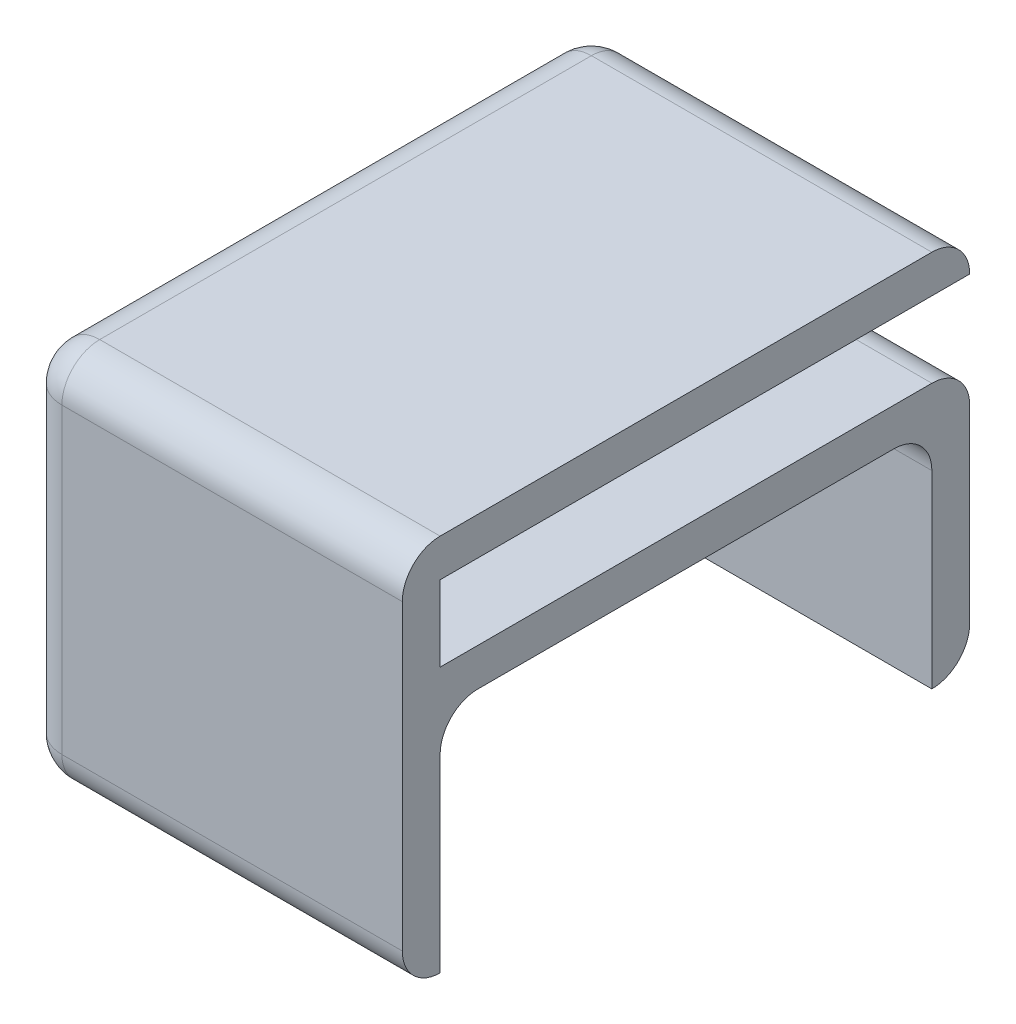
ISO-10303-21;
HEADER;
FILE_DESCRIPTION(('STEP AP214'),'2;1');
FILE_NAME('part.step','',(''),(''),'','','');
FILE_SCHEMA(('AUTOMOTIVE_DESIGN { 1 0 10303 214 1 1 1 1 }'));
ENDSEC;
DATA;
#1=APPLICATION_CONTEXT('core data for automotive mechanical design processes');
#2=APPLICATION_PROTOCOL_DEFINITION('international standard','automotive_design',2000,#1);
#3=PRODUCT_CONTEXT('',#1,'mechanical');
#4=PRODUCT('Part','Part','',(#3));
#5=PRODUCT_RELATED_PRODUCT_CATEGORY('part','',(#4));
#6=PRODUCT_DEFINITION_FORMATION('','',#4);
#7=PRODUCT_DEFINITION_CONTEXT('part definition',#1,'design');
#8=PRODUCT_DEFINITION('design','',#6,#7);
#9=PRODUCT_DEFINITION_SHAPE('','',#8);
#10=(LENGTH_UNIT() NAMED_UNIT(*) SI_UNIT(.MILLI.,.METRE.));
#11=(NAMED_UNIT(*) PLANE_ANGLE_UNIT() SI_UNIT($,.RADIAN.));
#12=(NAMED_UNIT(*) SI_UNIT($,.STERADIAN.) SOLID_ANGLE_UNIT());
#13=UNCERTAINTY_MEASURE_WITH_UNIT(LENGTH_MEASURE(1.E-05),#10,'distance_accuracy_value','');
#14=(GEOMETRIC_REPRESENTATION_CONTEXT(3) GLOBAL_UNCERTAINTY_ASSIGNED_CONTEXT((#13)) GLOBAL_UNIT_ASSIGNED_CONTEXT((#10,
#11,#12)) REPRESENTATION_CONTEXT('',''));
#15=CARTESIAN_POINT('',(0.,0.,0.));
#16=DIRECTION('',(0.,0.,1.));
#17=DIRECTION('',(1.,0.,0.));
#18=AXIS2_PLACEMENT_3D('',#15,#16,#17);
#19=CARTESIAN_POINT('',(1.,10.,0.));
#20=DIRECTION('',(1.,0.,0.));
#21=DIRECTION('',(0.,0.,-1.));
#22=AXIS2_PLACEMENT_3D('',#19,#20,#21);
#23=PLANE('',#22);
#24=DIRECTION('',(0.,-1.,0.));
#25=VECTOR('',#24,1.);
#26=CARTESIAN_POINT('',(1.,10.,-14.));
#27=LINE('',#26,#25);
#28=CARTESIAN_POINT('',(1.,5.,-14.));
#29=VERTEX_POINT('',#28);
#30=CARTESIAN_POINT('',(1.,0.,-14.));
#31=VERTEX_POINT('',#30);
#32=EDGE_CURVE('E179',#29,#31,#27,.T.);
#33=ORIENTED_EDGE('',*,*,#32,.F.);
#34=CARTESIAN_POINT('',(1.,5.,-13.));
#35=DIRECTION('',(1.,0.,0.));
#36=DIRECTION('',(0.,0.,-1.));
#37=AXIS2_PLACEMENT_3D('',#34,#35,#36);
#38=CIRCLE('',#37,1.);
#39=CARTESIAN_POINT('',(1.,6.,-13.));
#40=VERTEX_POINT('',#39);
#41=EDGE_CURVE('E260',#29,#40,#38,.T.);
#42=ORIENTED_EDGE('',*,*,#41,.T.);
#43=DIRECTION('',(0.,0.,-1.));
#44=VECTOR('',#43,1.);
#45=CARTESIAN_POINT('',(1.,6.,0.00200000000000027));
#46=LINE('',#45,#44);
#47=CARTESIAN_POINT('',(1.,6.,-2.));
#48=VERTEX_POINT('',#47);
#49=EDGE_CURVE('E287',#48,#40,#46,.T.);
#50=ORIENTED_EDGE('',*,*,#49,.F.);
#51=CARTESIAN_POINT('',(1.,5.,-2.));
#52=DIRECTION('',(1.,0.,0.));
#53=DIRECTION('',(0.,0.,-1.));
#54=AXIS2_PLACEMENT_3D('',#51,#52,#53);
#55=CIRCLE('',#54,1.);
#56=CARTESIAN_POINT('',(1.,5.,-1.));
#57=VERTEX_POINT('',#56);
#58=EDGE_CURVE('E56',#48,#57,#55,.T.);
#59=ORIENTED_EDGE('',*,*,#58,.T.);
#60=DIRECTION('',(0.,-1.,0.));
#61=VECTOR('',#60,1.);
#62=CARTESIAN_POINT('',(1.,10.,-1.));
#63=LINE('',#62,#61);
#64=CARTESIAN_POINT('',(1.,0.,-1.));
#65=VERTEX_POINT('',#64);
#66=EDGE_CURVE('E315',#57,#65,#63,.T.);
#67=ORIENTED_EDGE('',*,*,#66,.T.);
#68=DIRECTION('',(0.,0.,1.));
#69=VECTOR('',#68,1.);
#70=CARTESIAN_POINT('',(1.,0.,-14.));
#71=LINE('',#70,#69);
#72=EDGE_CURVE('E413',#31,#65,#71,.T.);
#73=ORIENTED_EDGE('',*,*,#72,.F.);
#74=EDGE_LOOP('',(#33,#42,#50,#59,#67,#73));
#75=FACE_BOUND('',#74,.T.);
#76=ADVANCED_FACE('F40',(#75),#23,.T.);
#77=CARTESIAN_POINT('',(1.,9.,-1.));
#78=VERTEX_POINT('',#77);
#79=CARTESIAN_POINT('',(1.,7.,-1.));
#80=VERTEX_POINT('',#79);
#81=EDGE_CURVE('E310',#78,#80,#63,.T.);
#82=ORIENTED_EDGE('',*,*,#81,.T.);
#83=DIRECTION('',(0.,0.,-1.));
#84=VECTOR('',#83,1.);
#85=CARTESIAN_POINT('',(1.,7.,0.00200000000000027));
#86=LINE('',#85,#84);
#87=CARTESIAN_POINT('',(1.,7.,-14.));
#88=VERTEX_POINT('',#87);
#89=EDGE_CURVE('E306',#80,#88,#86,.T.);
#90=ORIENTED_EDGE('',*,*,#89,.T.);
#91=CARTESIAN_POINT('',(1.,6.,-14.));
#92=DIRECTION('',(1.,0.,0.));
#93=DIRECTION('',(0.,0.,-1.));
#94=AXIS2_PLACEMENT_3D('',#91,#92,#93);
#95=CIRCLE('',#94,1.);
#96=CARTESIAN_POINT('',(1.,6.,-15.));
#97=VERTEX_POINT('',#96);
#98=EDGE_CURVE('E266',#88,#97,#95,.F.);
#99=ORIENTED_EDGE('',*,*,#98,.T.);
#100=DIRECTION('',(0.,-1.,0.));
#101=VECTOR('',#100,1.);
#102=CARTESIAN_POINT('',(1.,9.,-15.));
#103=LINE('',#102,#101);
#104=CARTESIAN_POINT('',(1.,9.,-15.));
#105=VERTEX_POINT('',#104);
#106=EDGE_CURVE('E192',#105,#97,#103,.T.);
#107=ORIENTED_EDGE('',*,*,#106,.F.);
#108=DIRECTION('',(0.,0.,1.));
#109=VECTOR('',#108,1.);
#110=CARTESIAN_POINT('',(1.,9.,0.));
#111=LINE('',#110,#109);
#112=EDGE_CURVE('E186',#105,#78,#111,.T.);
#113=ORIENTED_EDGE('',*,*,#112,.T.);
#114=EDGE_LOOP('',(#82,#90,#99,#107,#113));
#115=FACE_BOUND('',#114,.T.);
#116=ADVANCED_FACE('F411',(#115),#23,.T.);
#117=CARTESIAN_POINT('',(0.,10.,-1.));
#118=DIRECTION('',(0.,0.,-1.));
#119=DIRECTION('',(-1.,0.,0.));
#120=AXIS2_PLACEMENT_3D('',#117,#118,#119);
#121=PLANE('',#120);
#122=ORIENTED_EDGE('',*,*,#66,.F.);
#123=DIRECTION('',(-1.,0.,0.));
#124=VECTOR('',#123,1.);
#125=CARTESIAN_POINT('',(0.,5.,-1.));
#126=LINE('',#125,#124);
#127=CARTESIAN_POINT('',(10.,5.,-1.));
#128=VERTEX_POINT('',#127);
#129=EDGE_CURVE('E263',#57,#128,#126,.F.);
#130=ORIENTED_EDGE('',*,*,#129,.T.);
#131=DIRECTION('',(0.,-1.,0.));
#132=VECTOR('',#131,1.);
#133=CARTESIAN_POINT('',(10.,10.,-1.));
#134=LINE('',#133,#132);
#135=CARTESIAN_POINT('',(10.,0.,-1.));
#136=VERTEX_POINT('',#135);
#137=EDGE_CURVE('E282',#128,#136,#134,.T.);
#138=ORIENTED_EDGE('',*,*,#137,.T.);
#139=DIRECTION('',(1.,0.,0.));
#140=VECTOR('',#139,1.);
#141=CARTESIAN_POINT('',(1.,0.,-1.));
#142=LINE('',#141,#140);
#143=EDGE_CURVE('E417',#65,#136,#142,.T.);
#144=ORIENTED_EDGE('',*,*,#143,.F.);
#145=EDGE_LOOP('',(#122,#130,#138,#144));
#146=FACE_BOUND('',#145,.T.);
#147=ADVANCED_FACE('F457',(#146),#121,.T.);
#148=CARTESIAN_POINT('',(10.,9.,-1.));
#149=VERTEX_POINT('',#148);
#150=CARTESIAN_POINT('',(10.,7.,-1.));
#151=VERTEX_POINT('',#150);
#152=EDGE_CURVE('E175',#149,#151,#134,.T.);
#153=ORIENTED_EDGE('',*,*,#152,.T.);
#154=DIRECTION('',(1.,0.,0.));
#155=VECTOR('',#154,1.);
#156=CARTESIAN_POINT('',(1.,7.,-1.));
#157=LINE('',#156,#155);
#158=EDGE_CURVE('E293',#80,#151,#157,.T.);
#159=ORIENTED_EDGE('',*,*,#158,.F.);
#160=ORIENTED_EDGE('',*,*,#81,.F.);
#161=DIRECTION('',(1.,0.,0.));
#162=VECTOR('',#161,1.);
#163=CARTESIAN_POINT('',(0.,9.,-1.));
#164=LINE('',#163,#162);
#165=EDGE_CURVE('E180',#78,#149,#164,.T.);
#166=ORIENTED_EDGE('',*,*,#165,.T.);
#167=EDGE_LOOP('',(#153,#159,#160,#166));
#168=FACE_BOUND('',#167,.T.);
#169=ADVANCED_FACE('F409',(#168),#121,.T.);
#170=CARTESIAN_POINT('',(0.,10.,-14.));
#171=DIRECTION('',(0.,0.,1.));
#172=DIRECTION('',(1.,0.,0.));
#173=AXIS2_PLACEMENT_3D('',#170,#171,#172);
#174=PLANE('',#173);
#175=DIRECTION('',(0.,-1.,0.));
#176=VECTOR('',#175,1.);
#177=CARTESIAN_POINT('',(10.,10.,-14.));
#178=LINE('',#177,#176);
#179=CARTESIAN_POINT('',(10.,5.,-14.));
#180=VERTEX_POINT('',#179);
#181=CARTESIAN_POINT('',(10.,0.,-14.));
#182=VERTEX_POINT('',#181);
#183=EDGE_CURVE('E271',#180,#182,#178,.T.);
#184=ORIENTED_EDGE('',*,*,#183,.F.);
#185=DIRECTION('',(1.,0.,0.));
#186=VECTOR('',#185,1.);
#187=CARTESIAN_POINT('',(0.,5.,-14.));
#188=LINE('',#187,#186);
#189=EDGE_CURVE('E64',#180,#29,#188,.F.);
#190=ORIENTED_EDGE('',*,*,#189,.T.);
#191=ORIENTED_EDGE('',*,*,#32,.T.);
#192=DIRECTION('',(-1.,0.,0.));
#193=VECTOR('',#192,1.);
#194=CARTESIAN_POINT('',(1.,0.,-14.));
#195=LINE('',#194,#193);
#196=EDGE_CURVE('E279',#182,#31,#195,.T.);
#197=ORIENTED_EDGE('',*,*,#196,.F.);
#198=EDGE_LOOP('',(#184,#190,#191,#197));
#199=FACE_BOUND('',#198,.T.);
#200=ADVANCED_FACE('F277',(#199),#174,.T.);
#201=CARTESIAN_POINT('',(10.,10.,0.));
#202=DIRECTION('',(-1.,0.,0.));
#203=DIRECTION('',(0.,0.,1.));
#204=AXIS2_PLACEMENT_3D('',#201,#202,#203);
#205=PLANE('',#204);
#206=DIRECTION('',(0.,-1.,0.));
#207=VECTOR('',#206,1.);
#208=CARTESIAN_POINT('',(10.,10.,-15.));
#209=LINE('',#208,#207);
#210=CARTESIAN_POINT('',(10.,6.,-15.));
#211=VERTEX_POINT('',#210);
#212=CARTESIAN_POINT('',(10.,0.999999999999999,-15.));
#213=VERTEX_POINT('',#212);
#214=EDGE_CURVE('E326',#211,#213,#209,.T.);
#215=ORIENTED_EDGE('',*,*,#214,.F.);
#216=CARTESIAN_POINT('',(10.,6.,-14.));
#217=DIRECTION('',(-1.,0.,0.));
#218=DIRECTION('',(0.,0.,1.));
#219=AXIS2_PLACEMENT_3D('',#216,#217,#218);
#220=CIRCLE('',#219,1.);
#221=CARTESIAN_POINT('',(10.,7.,-14.));
#222=VERTEX_POINT('',#221);
#223=EDGE_CURVE('E242',#211,#222,#220,.F.);
#224=ORIENTED_EDGE('',*,*,#223,.T.);
#225=DIRECTION('',(0.,0.,-1.));
#226=VECTOR('',#225,1.);
#227=CARTESIAN_POINT('',(10.,7.,0.00200000000000027));
#228=LINE('',#227,#226);
#229=EDGE_CURVE('E297',#151,#222,#228,.T.);
#230=ORIENTED_EDGE('',*,*,#229,.F.);
#231=ORIENTED_EDGE('',*,*,#152,.F.);
#232=DIRECTION('',(0.,0.,-1.));
#233=VECTOR('',#232,1.);
#234=CARTESIAN_POINT('',(10.,9.,0.));
#235=LINE('',#234,#233);
#236=CARTESIAN_POINT('',(10.,9.,-15.));
#237=VERTEX_POINT('',#236);
#238=EDGE_CURVE('E165',#149,#237,#235,.T.);
#239=ORIENTED_EDGE('',*,*,#238,.T.);
#240=CARTESIAN_POINT('',(10.,9.,-14.));
#241=DIRECTION('',(-1.,0.,0.));
#242=DIRECTION('',(0.,0.,1.));
#243=AXIS2_PLACEMENT_3D('',#240,#241,#242);
#244=CIRCLE('',#243,1.);
#245=CARTESIAN_POINT('',(10.,10.,-14.));
#246=VERTEX_POINT('',#245);
#247=EDGE_CURVE('E171',#237,#246,#244,.F.);
#248=ORIENTED_EDGE('',*,*,#247,.T.);
#249=DIRECTION('',(0.,0.,-1.));
#250=VECTOR('',#249,1.);
#251=CARTESIAN_POINT('',(10.,10.,0.));
#252=LINE('',#251,#250);
#253=CARTESIAN_POINT('',(10.,10.,-1.));
#254=VERTEX_POINT('',#253);
#255=EDGE_CURVE('E314',#254,#246,#252,.T.);
#256=ORIENTED_EDGE('',*,*,#255,.F.);
#257=CARTESIAN_POINT('',(10.,9.,-1.));
#258=DIRECTION('',(-1.,0.,0.));
#259=DIRECTION('',(0.,0.,1.));
#260=AXIS2_PLACEMENT_3D('',#257,#258,#259);
#261=CIRCLE('',#260,1.);
#262=CARTESIAN_POINT('',(10.,9.,0.));
#263=VERTEX_POINT('',#262);
#264=EDGE_CURVE('E357',#254,#263,#261,.F.);
#265=ORIENTED_EDGE('',*,*,#264,.T.);
#266=DIRECTION('',(0.,-1.,0.));
#267=VECTOR('',#266,1.);
#268=CARTESIAN_POINT('',(10.,10.,0.));
#269=LINE('',#268,#267);
#270=CARTESIAN_POINT('',(10.,0.999999999999999,0.));
#271=VERTEX_POINT('',#270);
#272=EDGE_CURVE('E329',#263,#271,#269,.T.);
#273=ORIENTED_EDGE('',*,*,#272,.T.);
#274=CARTESIAN_POINT('',(10.,0.999999999999999,-1.));
#275=DIRECTION('',(-1.,0.,0.));
#276=DIRECTION('',(0.,0.,1.));
#277=AXIS2_PLACEMENT_3D('',#274,#275,#276);
#278=CIRCLE('',#277,1.);
#279=EDGE_CURVE('E360',#271,#136,#278,.F.);
#280=ORIENTED_EDGE('',*,*,#279,.T.);
#281=ORIENTED_EDGE('',*,*,#137,.F.);
#282=CARTESIAN_POINT('',(10.,5.,-2.));
#283=DIRECTION('',(-1.,0.,0.));
#284=DIRECTION('',(0.,0.,1.));
#285=AXIS2_PLACEMENT_3D('',#282,#283,#284);
#286=CIRCLE('',#285,1.);
#287=CARTESIAN_POINT('',(10.,6.,-2.));
#288=VERTEX_POINT('',#287);
#289=EDGE_CURVE('E11',#128,#288,#286,.T.);
#290=ORIENTED_EDGE('',*,*,#289,.T.);
#291=DIRECTION('',(0.,0.,-1.));
#292=VECTOR('',#291,1.);
#293=CARTESIAN_POINT('',(10.,6.,0.00200000000000027));
#294=LINE('',#293,#292);
#295=CARTESIAN_POINT('',(10.,6.,-13.));
#296=VERTEX_POINT('',#295);
#297=EDGE_CURVE('E274',#288,#296,#294,.T.);
#298=ORIENTED_EDGE('',*,*,#297,.T.);
#299=CARTESIAN_POINT('',(10.,5.,-13.));
#300=DIRECTION('',(-1.,0.,0.));
#301=DIRECTION('',(0.,0.,1.));
#302=AXIS2_PLACEMENT_3D('',#299,#300,#301);
#303=CIRCLE('',#302,1.);
#304=EDGE_CURVE('E49',#296,#180,#303,.T.);
#305=ORIENTED_EDGE('',*,*,#304,.T.);
#306=ORIENTED_EDGE('',*,*,#183,.T.);
#307=CARTESIAN_POINT('',(10.,0.999999999999999,-14.));
#308=DIRECTION('',(-1.,0.,0.));
#309=DIRECTION('',(0.,0.,1.));
#310=AXIS2_PLACEMENT_3D('',#307,#308,#309);
#311=CIRCLE('',#310,1.);
#312=EDGE_CURVE('E199',#182,#213,#311,.F.);
#313=ORIENTED_EDGE('',*,*,#312,.T.);
#314=EDGE_LOOP('',(#215,#224,#230,#231,#239,#248,#256,#265,#273,#280,#281,#290,#298,#305,#306,#313));
#315=FACE_BOUND('',#314,.T.);
#316=ADVANCED_FACE('F168',(#315),#205,.F.);
#317=CARTESIAN_POINT('',(0.,10.,0.));
#318=DIRECTION('',(1.,0.,0.));
#319=DIRECTION('',(0.,0.,-1.));
#320=AXIS2_PLACEMENT_3D('',#317,#318,#319);
#321=PLANE('',#320);
#322=DIRECTION('',(0.,0.,1.));
#323=VECTOR('',#322,1.);
#324=CARTESIAN_POINT('',(0.,9.,0.));
#325=LINE('',#324,#323);
#326=CARTESIAN_POINT('',(0.,9.,-1.));
#327=VERTEX_POINT('',#326);
#328=CARTESIAN_POINT('',(0.,9.,-14.));
#329=VERTEX_POINT('',#328);
#330=EDGE_CURVE('E337',#327,#329,#325,.F.);
#331=ORIENTED_EDGE('',*,*,#330,.T.);
#332=DIRECTION('',(0.,-1.,0.));
#333=VECTOR('',#332,1.);
#334=CARTESIAN_POINT('',(0.,10.,-14.));
#335=LINE('',#334,#333);
#336=CARTESIAN_POINT('',(0.,0.999999999999999,-14.));
#337=VERTEX_POINT('',#336);
#338=EDGE_CURVE('E215',#329,#337,#335,.T.);
#339=ORIENTED_EDGE('',*,*,#338,.T.);
#340=DIRECTION('',(0.,0.,1.));
#341=VECTOR('',#340,1.);
#342=CARTESIAN_POINT('',(0.,0.999999999999999,0.));
#343=LINE('',#342,#341);
#344=CARTESIAN_POINT('',(0.,0.999999999999999,-1.));
#345=VERTEX_POINT('',#344);
#346=EDGE_CURVE('E341',#337,#345,#343,.T.);
#347=ORIENTED_EDGE('',*,*,#346,.T.);
#348=DIRECTION('',(0.,-1.,0.));
#349=VECTOR('',#348,1.);
#350=CARTESIAN_POINT('',(0.,10.,-1.));
#351=LINE('',#350,#349);
#352=EDGE_CURVE('E368',#345,#327,#351,.F.);
#353=ORIENTED_EDGE('',*,*,#352,.T.);
#354=EDGE_LOOP('',(#331,#339,#347,#353));
#355=FACE_BOUND('',#354,.T.);
#356=ADVANCED_FACE('F466',(#355),#321,.F.);
#357=CARTESIAN_POINT('',(0.,10.,0.));
#358=DIRECTION('',(0.,0.,-1.));
#359=DIRECTION('',(-1.,0.,0.));
#360=AXIS2_PLACEMENT_3D('',#357,#358,#359);
#361=PLANE('',#360);
#362=DIRECTION('',(0.,-1.,0.));
#363=VECTOR('',#362,1.);
#364=CARTESIAN_POINT('',(1.,10.,0.));
#365=LINE('',#364,#363);
#366=CARTESIAN_POINT('',(1.,9.,0.));
#367=VERTEX_POINT('',#366);
#368=CARTESIAN_POINT('',(1.,0.999999999999999,0.));
#369=VERTEX_POINT('',#368);
#370=EDGE_CURVE('E350',#367,#369,#365,.T.);
#371=ORIENTED_EDGE('',*,*,#370,.T.);
#372=DIRECTION('',(1.,0.,0.));
#373=VECTOR('',#372,1.);
#374=CARTESIAN_POINT('',(10.,0.999999999999999,0.));
#375=LINE('',#374,#373);
#376=EDGE_CURVE('E353',#369,#271,#375,.T.);
#377=ORIENTED_EDGE('',*,*,#376,.T.);
#378=ORIENTED_EDGE('',*,*,#272,.F.);
#379=DIRECTION('',(1.,0.,0.));
#380=VECTOR('',#379,1.);
#381=CARTESIAN_POINT('',(0.,9.,0.));
#382=LINE('',#381,#380);
#383=EDGE_CURVE('E347',#263,#367,#382,.F.);
#384=ORIENTED_EDGE('',*,*,#383,.T.);
#385=EDGE_LOOP('',(#371,#377,#378,#384));
#386=FACE_BOUND('',#385,.T.);
#387=ADVANCED_FACE('F584',(#386),#361,.F.);
#388=CARTESIAN_POINT('',(0.,10.,-15.));
#389=DIRECTION('',(0.,0.,1.));
#390=DIRECTION('',(1.,0.,0.));
#391=AXIS2_PLACEMENT_3D('',#388,#389,#390);
#392=PLANE('',#391);
#393=DIRECTION('',(0.,-1.,0.));
#394=VECTOR('',#393,1.);
#395=CARTESIAN_POINT('',(1.,10.,-15.));
#396=LINE('',#395,#394);
#397=CARTESIAN_POINT('',(1.,0.999999999999999,-15.));
#398=VERTEX_POINT('',#397);
#399=EDGE_CURVE('E208',#398,#97,#396,.F.);
#400=ORIENTED_EDGE('',*,*,#399,.T.);
#401=DIRECTION('',(1.,0.,0.));
#402=VECTOR('',#401,1.);
#403=CARTESIAN_POINT('',(0.,6.,-15.));
#404=LINE('',#403,#402);
#405=EDGE_CURVE('E223',#97,#211,#404,.T.);
#406=ORIENTED_EDGE('',*,*,#405,.T.);
#407=ORIENTED_EDGE('',*,*,#214,.T.);
#408=DIRECTION('',(-1.,0.,0.));
#409=VECTOR('',#408,1.);
#410=CARTESIAN_POINT('',(1.,0.999999999999999,-15.));
#411=LINE('',#410,#409);
#412=EDGE_CURVE('E200',#213,#398,#411,.T.);
#413=ORIENTED_EDGE('',*,*,#412,.T.);
#414=EDGE_LOOP('',(#400,#406,#407,#413));
#415=FACE_BOUND('',#414,.T.);
#416=ADVANCED_FACE('F396',(#415),#392,.F.);
#417=CARTESIAN_POINT('',(0.,10.,0.));
#418=DIRECTION('',(0.,-1.,0.));
#419=DIRECTION('',(0.,0.,-1.));
#420=AXIS2_PLACEMENT_3D('',#417,#418,#419);
#421=PLANE('',#420);
#422=ORIENTED_EDGE('',*,*,#255,.T.);
#423=DIRECTION('',(-1.,0.,0.));
#424=VECTOR('',#423,1.);
#425=CARTESIAN_POINT('',(0.,10.,-14.));
#426=LINE('',#425,#424);
#427=CARTESIAN_POINT('',(1.,10.,-14.));
#428=VERTEX_POINT('',#427);
#429=EDGE_CURVE('E197',#246,#428,#426,.T.);
#430=ORIENTED_EDGE('',*,*,#429,.T.);
#431=DIRECTION('',(0.,0.,1.));
#432=VECTOR('',#431,1.);
#433=CARTESIAN_POINT('',(1.,10.,0.));
#434=LINE('',#433,#432);
#435=CARTESIAN_POINT('',(1.,10.,-1.));
#436=VERTEX_POINT('',#435);
#437=EDGE_CURVE('E344',#428,#436,#434,.T.);
#438=ORIENTED_EDGE('',*,*,#437,.T.);
#439=DIRECTION('',(1.,0.,0.));
#440=VECTOR('',#439,1.);
#441=CARTESIAN_POINT('',(0.,10.,-1.));
#442=LINE('',#441,#440);
#443=EDGE_CURVE('E375',#436,#254,#442,.T.);
#444=ORIENTED_EDGE('',*,*,#443,.T.);
#445=EDGE_LOOP('',(#422,#430,#438,#444));
#446=FACE_BOUND('',#445,.T.);
#447=ADVANCED_FACE('F439',(#446),#421,.F.);
#448=CARTESIAN_POINT('',(0.,9.,0.));
#449=DIRECTION('',(0.,-1.,0.));
#450=DIRECTION('',(0.,0.,-1.));
#451=AXIS2_PLACEMENT_3D('',#448,#449,#450);
#452=PLANE('',#451);
#453=CARTESIAN_POINT('',(7.5,9.,-2.5));
#454=DIRECTION('',(0.,-1.,0.));
#455=DIRECTION('',(0.,0.,-1.));
#456=AXIS2_PLACEMENT_3D('',#453,#454,#455);
#457=CIRCLE('',#456,0.5);
#458=CARTESIAN_POINT('',(7.5,9.,-3.));
#459=VERTEX_POINT('',#458);
#460=EDGE_CURVE('E429',#459,#459,#457,.T.);
#461=ORIENTED_EDGE('',*,*,#460,.F.);
#462=EDGE_LOOP('',(#461));
#463=FACE_BOUND('',#462,.T.);
#464=ORIENTED_EDGE('',*,*,#112,.F.);
#465=DIRECTION('',(1.,0.,0.));
#466=VECTOR('',#465,1.);
#467=CARTESIAN_POINT('',(-1.23606797749979,9.,-15.));
#468=LINE('',#467,#466);
#469=EDGE_CURVE('E183',#105,#237,#468,.T.);
#470=ORIENTED_EDGE('',*,*,#469,.T.);
#471=ORIENTED_EDGE('',*,*,#238,.F.);
#472=ORIENTED_EDGE('',*,*,#165,.F.);
#473=EDGE_LOOP('',(#464,#470,#471,#472));
#474=FACE_BOUND('',#473,.T.);
#475=ADVANCED_FACE('F184',(#463,#474),#452,.T.);
#476=CARTESIAN_POINT('',(1.,6.,0.00200000000000027));
#477=DIRECTION('',(0.,1.,0.));
#478=DIRECTION('',(0.,0.,1.));
#479=AXIS2_PLACEMENT_3D('',#476,#477,#478);
#480=PLANE('',#479);
#481=ORIENTED_EDGE('',*,*,#49,.T.);
#482=DIRECTION('',(1.,0.,0.));
#483=VECTOR('',#482,1.);
#484=CARTESIAN_POINT('',(1.,6.,-13.));
#485=LINE('',#484,#483);
#486=EDGE_CURVE('E252',#40,#296,#485,.T.);
#487=ORIENTED_EDGE('',*,*,#486,.T.);
#488=ORIENTED_EDGE('',*,*,#297,.F.);
#489=DIRECTION('',(-1.,0.,0.));
#490=VECTOR('',#489,1.);
#491=CARTESIAN_POINT('',(1.,6.,-2.));
#492=LINE('',#491,#490);
#493=EDGE_CURVE('E248',#288,#48,#492,.T.);
#494=ORIENTED_EDGE('',*,*,#493,.T.);
#495=EDGE_LOOP('',(#481,#487,#488,#494));
#496=FACE_BOUND('',#495,.T.);
#497=ADVANCED_FACE('F290',(#496),#480,.F.);
#498=CARTESIAN_POINT('',(1.,7.,0.00200000000000027));
#499=DIRECTION('',(0.,-1.,0.));
#500=DIRECTION('',(0.,0.,-1.));
#501=AXIS2_PLACEMENT_3D('',#498,#499,#500);
#502=PLANE('',#501);
#503=CARTESIAN_POINT('',(7.5,7.,-2.5));
#504=DIRECTION('',(0.,-1.,0.));
#505=DIRECTION('',(0.,0.,-1.));
#506=AXIS2_PLACEMENT_3D('',#503,#504,#505);
#507=CIRCLE('',#506,0.500000000000001);
#508=CARTESIAN_POINT('',(7.5,7.,-3.));
#509=VERTEX_POINT('',#508);
#510=EDGE_CURVE('E333',#509,#509,#507,.F.);
#511=ORIENTED_EDGE('',*,*,#510,.F.);
#512=EDGE_LOOP('',(#511));
#513=FACE_BOUND('',#512,.T.);
#514=ORIENTED_EDGE('',*,*,#229,.T.);
#515=DIRECTION('',(1.,0.,0.));
#516=VECTOR('',#515,1.);
#517=CARTESIAN_POINT('',(1.,7.,-14.));
#518=LINE('',#517,#516);
#519=EDGE_CURVE('E245',#222,#88,#518,.F.);
#520=ORIENTED_EDGE('',*,*,#519,.T.);
#521=ORIENTED_EDGE('',*,*,#89,.F.);
#522=ORIENTED_EDGE('',*,*,#158,.T.);
#523=EDGE_LOOP('',(#514,#520,#521,#522));
#524=FACE_BOUND('',#523,.T.);
#525=ADVANCED_FACE('F405',(#513,#524),#502,.F.);
#526=CARTESIAN_POINT('',(7.5,8.5,-2.5));
#527=DIRECTION('',(0.,1.,0.));
#528=DIRECTION('',(0.,0.,1.));
#529=AXIS2_PLACEMENT_3D('',#526,#527,#528);
#530=CYLINDRICAL_SURFACE('',#529,0.5);
#531=CARTESIAN_POINT('',(7.5,8.5,-2.5));
#532=DIRECTION('',(0.,-1.,0.));
#533=DIRECTION('',(0.,0.,-1.));
#534=AXIS2_PLACEMENT_3D('',#531,#532,#533);
#535=CIRCLE('',#534,0.5);
#536=CARTESIAN_POINT('',(7.5,8.5,-3.));
#537=VERTEX_POINT('',#536);
#538=EDGE_CURVE('E299',#537,#537,#535,.T.);
#539=ORIENTED_EDGE('',*,*,#538,.F.);
#540=EDGE_LOOP('',(#539));
#541=FACE_BOUND('',#540,.T.);
#542=ORIENTED_EDGE('',*,*,#460,.T.);
#543=EDGE_LOOP('',(#542));
#544=FACE_BOUND('',#543,.T.);
#545=ADVANCED_FACE('F436',(#541,#544),#530,.T.);
#546=CARTESIAN_POINT('',(7.5,8.5,-2.5));
#547=DIRECTION('',(0.,-1.,0.));
#548=DIRECTION('',(0.,0.,-1.));
#549=AXIS2_PLACEMENT_3D('',#546,#547,#548);
#550=PLANE('',#549);
#551=ORIENTED_EDGE('',*,*,#538,.T.);
#552=EDGE_LOOP('',(#551));
#553=FACE_BOUND('',#552,.T.);
#554=ADVANCED_FACE('F657',(#553),#550,.T.);
#555=CARTESIAN_POINT('',(7.5,7.5,-2.5));
#556=DIRECTION('',(0.,-1.,0.));
#557=DIRECTION('',(0.,0.,-1.));
#558=AXIS2_PLACEMENT_3D('',#555,#556,#557);
#559=CYLINDRICAL_SURFACE('',#558,0.500000000000001);
#560=CARTESIAN_POINT('',(7.5,7.5,-2.5));
#561=DIRECTION('',(0.,1.,0.));
#562=DIRECTION('',(0.,0.,1.));
#563=AXIS2_PLACEMENT_3D('',#560,#561,#562);
#564=CIRCLE('',#563,0.500000000000001);
#565=CARTESIAN_POINT('',(7.5,7.5,-2.));
#566=VERTEX_POINT('',#565);
#567=EDGE_CURVE('E425',#566,#566,#564,.T.);
#568=ORIENTED_EDGE('',*,*,#567,.F.);
#569=EDGE_LOOP('',(#568));
#570=FACE_BOUND('',#569,.T.);
#571=ORIENTED_EDGE('',*,*,#510,.T.);
#572=EDGE_LOOP('',(#571));
#573=FACE_BOUND('',#572,.T.);
#574=ADVANCED_FACE('F647',(#570,#573),#559,.T.);
#575=CARTESIAN_POINT('',(7.5,7.5,-2.5));
#576=DIRECTION('',(0.,1.,0.));
#577=DIRECTION('',(0.,0.,1.));
#578=AXIS2_PLACEMENT_3D('',#575,#576,#577);
#579=PLANE('',#578);
#580=ORIENTED_EDGE('',*,*,#567,.T.);
#581=EDGE_LOOP('',(#580));
#582=FACE_BOUND('',#581,.T.);
#583=ADVANCED_FACE('F558',(#582),#579,.T.);
#584=CARTESIAN_POINT('',(1.,0.999999999999999,0.));
#585=DIRECTION('',(0.,0.,-1.));
#586=DIRECTION('',(-1.,0.,0.));
#587=AXIS2_PLACEMENT_3D('',#584,#585,#586);
#588=CYLINDRICAL_SURFACE('',#587,1.);
#589=ORIENTED_EDGE('',*,*,#346,.F.);
#590=CARTESIAN_POINT('',(1.,0.999999999999999,-14.));
#591=DIRECTION('',(0.,0.,-1.));
#592=DIRECTION('',(-1.,0.,0.));
#593=AXIS2_PLACEMENT_3D('',#590,#591,#592);
#594=CIRCLE('',#593,1.);
#595=EDGE_CURVE('E205',#337,#31,#594,.F.);
#596=ORIENTED_EDGE('',*,*,#595,.T.);
#597=ORIENTED_EDGE('',*,*,#72,.T.);
#598=CARTESIAN_POINT('',(1.,0.999999999999999,-1.));
#599=DIRECTION('',(0.,0.,-1.));
#600=DIRECTION('',(-1.,0.,0.));
#601=AXIS2_PLACEMENT_3D('',#598,#599,#600);
#602=CIRCLE('',#601,1.);
#603=EDGE_CURVE('E364',#65,#345,#602,.T.);
#604=ORIENTED_EDGE('',*,*,#603,.T.);
#605=EDGE_LOOP('',(#589,#596,#597,#604));
#606=FACE_BOUND('',#605,.T.);
#607=ADVANCED_FACE('F547',(#606),#588,.T.);
#608=CARTESIAN_POINT('',(1.,9.,0.));
#609=DIRECTION('',(0.,0.,1.));
#610=DIRECTION('',(1.,0.,0.));
#611=AXIS2_PLACEMENT_3D('',#608,#609,#610);
#612=CYLINDRICAL_SURFACE('',#611,1.);
#613=ORIENTED_EDGE('',*,*,#437,.F.);
#614=CARTESIAN_POINT('',(1.,9.,-14.));
#615=DIRECTION('',(0.,0.,1.));
#616=DIRECTION('',(1.,0.,0.));
#617=AXIS2_PLACEMENT_3D('',#614,#615,#616);
#618=CIRCLE('',#617,1.);
#619=EDGE_CURVE('E218',#428,#329,#618,.T.);
#620=ORIENTED_EDGE('',*,*,#619,.T.);
#621=ORIENTED_EDGE('',*,*,#330,.F.);
#622=CARTESIAN_POINT('',(1.,9.,-1.));
#623=DIRECTION('',(0.,0.,1.));
#624=DIRECTION('',(1.,0.,0.));
#625=AXIS2_PLACEMENT_3D('',#622,#623,#624);
#626=CIRCLE('',#625,1.);
#627=EDGE_CURVE('E371',#327,#436,#626,.F.);
#628=ORIENTED_EDGE('',*,*,#627,.T.);
#629=EDGE_LOOP('',(#613,#620,#621,#628));
#630=FACE_BOUND('',#629,.T.);
#631=ADVANCED_FACE('F541',(#630),#612,.T.);
#632=CARTESIAN_POINT('',(0.,9.,-1.));
#633=DIRECTION('',(1.,0.,0.));
#634=DIRECTION('',(0.,0.,-1.));
#635=AXIS2_PLACEMENT_3D('',#632,#633,#634);
#636=CYLINDRICAL_SURFACE('',#635,1.);
#637=ORIENTED_EDGE('',*,*,#264,.F.);
#638=ORIENTED_EDGE('',*,*,#443,.F.);
#639=CARTESIAN_POINT('',(1.,9.,-1.));
#640=DIRECTION('',(-1.,0.,0.));
#641=DIRECTION('',(0.,0.,1.));
#642=AXIS2_PLACEMENT_3D('',#639,#640,#641);
#643=CIRCLE('',#642,1.);
#644=EDGE_CURVE('E193',#367,#436,#643,.T.);
#645=ORIENTED_EDGE('',*,*,#644,.F.);
#646=ORIENTED_EDGE('',*,*,#383,.F.);
#647=EDGE_LOOP('',(#637,#638,#645,#646));
#648=FACE_BOUND('',#647,.T.);
#649=ADVANCED_FACE('F546',(#648),#636,.T.);
#650=CARTESIAN_POINT('',(1.,9.,-1.));
#651=DIRECTION('',(0.,0.,-1.));
#652=DIRECTION('',(-1.,0.,0.));
#653=AXIS2_PLACEMENT_3D('',#650,#651,#652);
#654=SPHERICAL_SURFACE('',#653,1.);
#655=ORIENTED_EDGE('',*,*,#644,.T.);
#656=ORIENTED_EDGE('',*,*,#627,.F.);
#657=CARTESIAN_POINT('',(1.,9.,-1.));
#658=DIRECTION('',(0.,-1.,0.));
#659=DIRECTION('',(0.,0.,-1.));
#660=AXIS2_PLACEMENT_3D('',#657,#658,#659);
#661=CIRCLE('',#660,1.);
#662=EDGE_CURVE('E385',#367,#327,#661,.T.);
#663=ORIENTED_EDGE('',*,*,#662,.F.);
#664=EDGE_LOOP('',(#655,#656,#663));
#665=FACE_BOUND('',#664,.T.);
#666=ADVANCED_FACE('F615',(#665),#654,.T.);
#667=CARTESIAN_POINT('',(1.,10.,-1.));
#668=DIRECTION('',(0.,-1.,0.));
#669=DIRECTION('',(0.,0.,-1.));
#670=AXIS2_PLACEMENT_3D('',#667,#668,#669);
#671=CYLINDRICAL_SURFACE('',#670,1.);
#672=ORIENTED_EDGE('',*,*,#662,.T.);
#673=ORIENTED_EDGE('',*,*,#352,.F.);
#674=CARTESIAN_POINT('',(1.,0.999999999999999,-1.));
#675=DIRECTION('',(0.,-1.,0.));
#676=DIRECTION('',(0.,0.,-1.));
#677=AXIS2_PLACEMENT_3D('',#674,#675,#676);
#678=CIRCLE('',#677,1.);
#679=EDGE_CURVE('E381',#369,#345,#678,.T.);
#680=ORIENTED_EDGE('',*,*,#679,.F.);
#681=ORIENTED_EDGE('',*,*,#370,.F.);
#682=EDGE_LOOP('',(#672,#673,#680,#681));
#683=FACE_BOUND('',#682,.T.);
#684=ADVANCED_FACE('F604',(#683),#671,.T.);
#685=CARTESIAN_POINT('',(1.,0.999999999999999,-1.));
#686=DIRECTION('',(0.,0.,-1.));
#687=DIRECTION('',(-1.,0.,0.));
#688=AXIS2_PLACEMENT_3D('',#685,#686,#687);
#689=SPHERICAL_SURFACE('',#688,1.);
#690=ORIENTED_EDGE('',*,*,#679,.T.);
#691=ORIENTED_EDGE('',*,*,#603,.F.);
#692=CARTESIAN_POINT('',(1.,0.999999999999999,-1.));
#693=DIRECTION('',(1.,0.,0.));
#694=DIRECTION('',(0.,0.,-1.));
#695=AXIS2_PLACEMENT_3D('',#692,#693,#694);
#696=CIRCLE('',#695,1.);
#697=EDGE_CURVE('E238',#369,#65,#696,.T.);
#698=ORIENTED_EDGE('',*,*,#697,.F.);
#699=EDGE_LOOP('',(#690,#691,#698));
#700=FACE_BOUND('',#699,.T.);
#701=ADVANCED_FACE('F594',(#700),#689,.T.);
#702=CARTESIAN_POINT('',(0.,0.999999999999999,-1.));
#703=DIRECTION('',(-1.,0.,0.));
#704=DIRECTION('',(0.,0.,1.));
#705=AXIS2_PLACEMENT_3D('',#702,#703,#704);
#706=CYLINDRICAL_SURFACE('',#705,1.);
#707=ORIENTED_EDGE('',*,*,#697,.T.);
#708=ORIENTED_EDGE('',*,*,#143,.T.);
#709=ORIENTED_EDGE('',*,*,#279,.F.);
#710=ORIENTED_EDGE('',*,*,#376,.F.);
#711=EDGE_LOOP('',(#707,#708,#709,#710));
#712=FACE_BOUND('',#711,.T.);
#713=ADVANCED_FACE('F534',(#712),#706,.T.);
#714=CARTESIAN_POINT('',(0.,9.,-14.));
#715=DIRECTION('',(-1.,0.,0.));
#716=DIRECTION('',(0.,0.,1.));
#717=AXIS2_PLACEMENT_3D('',#714,#715,#716);
#718=CYLINDRICAL_SURFACE('',#717,1.);
#719=CARTESIAN_POINT('',(1.,9.,-14.));
#720=DIRECTION('',(-1.,0.,0.));
#721=DIRECTION('',(0.,0.,1.));
#722=AXIS2_PLACEMENT_3D('',#719,#720,#721);
#723=CIRCLE('',#722,1.);
#724=EDGE_CURVE('E235',#428,#105,#723,.T.);
#725=ORIENTED_EDGE('',*,*,#724,.F.);
#726=ORIENTED_EDGE('',*,*,#429,.F.);
#727=ORIENTED_EDGE('',*,*,#247,.F.);
#728=ORIENTED_EDGE('',*,*,#469,.F.);
#729=EDGE_LOOP('',(#725,#726,#727,#728));
#730=FACE_BOUND('',#729,.T.);
#731=ADVANCED_FACE('F196',(#730),#718,.T.);
#732=CARTESIAN_POINT('',(1.,9.,-14.));
#733=DIRECTION('',(0.,0.,1.));
#734=DIRECTION('',(1.,0.,0.));
#735=AXIS2_PLACEMENT_3D('',#732,#733,#734);
#736=SPHERICAL_SURFACE('',#735,1.);
#737=ORIENTED_EDGE('',*,*,#619,.F.);
#738=ORIENTED_EDGE('',*,*,#724,.T.);
#739=CARTESIAN_POINT('',(1.,9.,-14.));
#740=DIRECTION('',(0.,-1.,0.));
#741=DIRECTION('',(0.,0.,-1.));
#742=AXIS2_PLACEMENT_3D('',#739,#740,#741);
#743=CIRCLE('',#742,1.);
#744=EDGE_CURVE('E231',#329,#105,#743,.T.);
#745=ORIENTED_EDGE('',*,*,#744,.F.);
#746=EDGE_LOOP('',(#737,#738,#745));
#747=FACE_BOUND('',#746,.T.);
#748=ADVANCED_FACE('F519',(#747),#736,.T.);
#749=CARTESIAN_POINT('',(1.,10.,-14.));
#750=DIRECTION('',(0.,-1.,0.));
#751=DIRECTION('',(0.,0.,-1.));
#752=AXIS2_PLACEMENT_3D('',#749,#750,#751);
#753=CYLINDRICAL_SURFACE('',#752,1.);
#754=CARTESIAN_POINT('',(1.,0.999999999999999,-14.));
#755=DIRECTION('',(0.,-1.,0.));
#756=DIRECTION('',(0.,0.,-1.));
#757=AXIS2_PLACEMENT_3D('',#754,#755,#756);
#758=CIRCLE('',#757,1.);
#759=EDGE_CURVE('E227',#337,#398,#758,.T.);
#760=ORIENTED_EDGE('',*,*,#759,.F.);
#761=ORIENTED_EDGE('',*,*,#338,.F.);
#762=ORIENTED_EDGE('',*,*,#744,.T.);
#763=ORIENTED_EDGE('',*,*,#106,.T.);
#764=ORIENTED_EDGE('',*,*,#399,.F.);
#765=EDGE_LOOP('',(#760,#761,#762,#763,#764));
#766=FACE_BOUND('',#765,.T.);
#767=ADVANCED_FACE('F510',(#766),#753,.T.);
#768=CARTESIAN_POINT('',(1.,0.999999999999999,-14.));
#769=DIRECTION('',(0.,0.,1.));
#770=DIRECTION('',(1.,0.,0.));
#771=AXIS2_PLACEMENT_3D('',#768,#769,#770);
#772=SPHERICAL_SURFACE('',#771,1.);
#773=ORIENTED_EDGE('',*,*,#595,.F.);
#774=ORIENTED_EDGE('',*,*,#759,.T.);
#775=CARTESIAN_POINT('',(1.,0.999999999999999,-14.));
#776=DIRECTION('',(1.,0.,0.));
#777=DIRECTION('',(0.,0.,-1.));
#778=AXIS2_PLACEMENT_3D('',#775,#776,#777);
#779=CIRCLE('',#778,1.);
#780=EDGE_CURVE('E224',#31,#398,#779,.T.);
#781=ORIENTED_EDGE('',*,*,#780,.F.);
#782=EDGE_LOOP('',(#773,#774,#781));
#783=FACE_BOUND('',#782,.T.);
#784=ADVANCED_FACE('F498',(#783),#772,.T.);
#785=CARTESIAN_POINT('',(0.,0.999999999999999,-14.));
#786=DIRECTION('',(1.,0.,0.));
#787=DIRECTION('',(0.,0.,-1.));
#788=AXIS2_PLACEMENT_3D('',#785,#786,#787);
#789=CYLINDRICAL_SURFACE('',#788,1.);
#790=ORIENTED_EDGE('',*,*,#312,.F.);
#791=ORIENTED_EDGE('',*,*,#196,.T.);
#792=ORIENTED_EDGE('',*,*,#780,.T.);
#793=ORIENTED_EDGE('',*,*,#412,.F.);
#794=EDGE_LOOP('',(#790,#791,#792,#793));
#795=FACE_BOUND('',#794,.T.);
#796=ADVANCED_FACE('F493',(#795),#789,.T.);
#797=CARTESIAN_POINT('',(0.,6.,-14.));
#798=DIRECTION('',(1.,0.,0.));
#799=DIRECTION('',(0.,0.,-1.));
#800=AXIS2_PLACEMENT_3D('',#797,#798,#799);
#801=CYLINDRICAL_SURFACE('',#800,1.);
#802=ORIENTED_EDGE('',*,*,#98,.F.);
#803=ORIENTED_EDGE('',*,*,#519,.F.);
#804=ORIENTED_EDGE('',*,*,#223,.F.);
#805=ORIENTED_EDGE('',*,*,#405,.F.);
#806=EDGE_LOOP('',(#802,#803,#804,#805));
#807=FACE_BOUND('',#806,.T.);
#808=ADVANCED_FACE('F402',(#807),#801,.T.);
#809=CARTESIAN_POINT('',(1.,5.,-13.));
#810=DIRECTION('',(1.,0.,0.));
#811=DIRECTION('',(0.,0.,-1.));
#812=AXIS2_PLACEMENT_3D('',#809,#810,#811);
#813=CYLINDRICAL_SURFACE('',#812,1.);
#814=ORIENTED_EDGE('',*,*,#41,.F.);
#815=ORIENTED_EDGE('',*,*,#189,.F.);
#816=ORIENTED_EDGE('',*,*,#304,.F.);
#817=ORIENTED_EDGE('',*,*,#486,.F.);
#818=EDGE_LOOP('',(#814,#815,#816,#817));
#819=FACE_BOUND('',#818,.T.);
#820=ADVANCED_FACE('F285',(#819),#813,.F.);
#821=CARTESIAN_POINT('',(1.,5.,-2.));
#822=DIRECTION('',(-1.,0.,0.));
#823=DIRECTION('',(0.,0.,1.));
#824=AXIS2_PLACEMENT_3D('',#821,#822,#823);
#825=CYLINDRICAL_SURFACE('',#824,1.);
#826=ORIENTED_EDGE('',*,*,#289,.F.);
#827=ORIENTED_EDGE('',*,*,#129,.F.);
#828=ORIENTED_EDGE('',*,*,#58,.F.);
#829=ORIENTED_EDGE('',*,*,#493,.F.);
#830=EDGE_LOOP('',(#826,#827,#828,#829));
#831=FACE_BOUND('',#830,.T.);
#832=ADVANCED_FACE('F42',(#831),#825,.F.);
#833=CLOSED_SHELL('',(#76,#116,#147,#169,#200,#316,#356,#387,#416,#447,#475,#497,#525,#545,#554,
#574,#583,#607,#631,#649,#666,#684,#701,#713,#731,#748,#767,#784,#796,#808,#820,#832));
#834=MANIFOLD_SOLID_BREP('B2',#833);
#835=ADVANCED_BREP_SHAPE_REPRESENTATION('',(#18,#834),#14);
#836=SHAPE_DEFINITION_REPRESENTATION(#9,#835);
ENDSEC;
END-ISO-10303-21;
